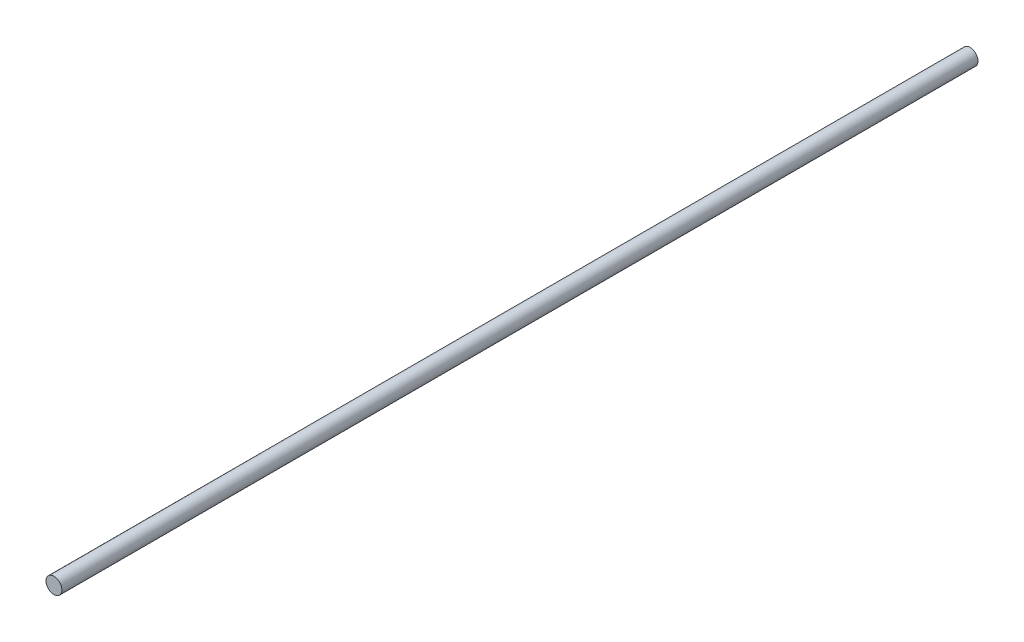
ISO-10303-21;
HEADER;
FILE_DESCRIPTION(('STEP AP214'),'2;1');
FILE_NAME('part.step','',(''),(''),'','','');
FILE_SCHEMA(('AUTOMOTIVE_DESIGN { 1 0 10303 214 1 1 1 1 }'));
ENDSEC;
DATA;
#1=APPLICATION_CONTEXT('core data for automotive mechanical design processes');
#2=APPLICATION_PROTOCOL_DEFINITION('international standard','automotive_design',2000,#1);
#3=PRODUCT_CONTEXT('',#1,'mechanical');
#4=PRODUCT('Part','Part','',(#3));
#5=PRODUCT_RELATED_PRODUCT_CATEGORY('part','',(#4));
#6=PRODUCT_DEFINITION_FORMATION('','',#4);
#7=PRODUCT_DEFINITION_CONTEXT('part definition',#1,'design');
#8=PRODUCT_DEFINITION('design','',#6,#7);
#9=PRODUCT_DEFINITION_SHAPE('','',#8);
#10=(LENGTH_UNIT() NAMED_UNIT(*) SI_UNIT(.MILLI.,.METRE.));
#11=(NAMED_UNIT(*) PLANE_ANGLE_UNIT() SI_UNIT($,.RADIAN.));
#12=(NAMED_UNIT(*) SI_UNIT($,.STERADIAN.) SOLID_ANGLE_UNIT());
#13=UNCERTAINTY_MEASURE_WITH_UNIT(LENGTH_MEASURE(1.E-05),#10,'distance_accuracy_value','');
#14=(GEOMETRIC_REPRESENTATION_CONTEXT(3) GLOBAL_UNCERTAINTY_ASSIGNED_CONTEXT((#13)) GLOBAL_UNIT_ASSIGNED_CONTEXT((#10,
#11,#12)) REPRESENTATION_CONTEXT('',''));
#15=CARTESIAN_POINT('',(0.,0.,0.));
#16=DIRECTION('',(0.,0.,1.));
#17=DIRECTION('',(1.,0.,0.));
#18=AXIS2_PLACEMENT_3D('',#15,#16,#17);
#19=CARTESIAN_POINT('',(0.,0.,75.));
#20=DIRECTION('',(0.,0.,-1.));
#21=DIRECTION('',(-1.,0.,0.));
#22=AXIS2_PLACEMENT_3D('',#19,#20,#21);
#23=CYLINDRICAL_SURFACE('',#22,0.65);
#24=CARTESIAN_POINT('',(0.,0.,75.));
#25=DIRECTION('',(0.,0.,1.));
#26=DIRECTION('',(1.,0.,0.));
#27=AXIS2_PLACEMENT_3D('',#24,#25,#26);
#28=CIRCLE('',#27,0.65);
#29=CARTESIAN_POINT('',(0.65,0.,75.));
#30=VERTEX_POINT('',#29);
#31=EDGE_CURVE('E10',#30,#30,#28,.T.);
#32=ORIENTED_EDGE('',*,*,#31,.F.);
#33=EDGE_LOOP('',(#32));
#34=FACE_BOUND('',#33,.T.);
#35=CARTESIAN_POINT('',(0.,0.,0.));
#36=DIRECTION('',(0.,0.,1.));
#37=DIRECTION('',(1.,0.,0.));
#38=AXIS2_PLACEMENT_3D('',#35,#36,#37);
#39=CIRCLE('',#38,0.65);
#40=CARTESIAN_POINT('',(0.65,0.,0.));
#41=VERTEX_POINT('',#40);
#42=EDGE_CURVE('E36',#41,#41,#39,.T.);
#43=ORIENTED_EDGE('',*,*,#42,.T.);
#44=EDGE_LOOP('',(#43));
#45=FACE_BOUND('',#44,.T.);
#46=ADVANCED_FACE('F33',(#34,#45),#23,.T.);
#47=CARTESIAN_POINT('',(0.,0.,75.));
#48=DIRECTION('',(0.,0.,1.));
#49=DIRECTION('',(1.,0.,0.));
#50=AXIS2_PLACEMENT_3D('',#47,#48,#49);
#51=PLANE('',#50);
#52=ORIENTED_EDGE('',*,*,#31,.T.);
#53=EDGE_LOOP('',(#52));
#54=FACE_BOUND('',#53,.T.);
#55=ADVANCED_FACE('F48',(#54),#51,.T.);
#56=CARTESIAN_POINT('',(0.,0.,0.));
#57=DIRECTION('',(0.,0.,1.));
#58=DIRECTION('',(1.,0.,0.));
#59=AXIS2_PLACEMENT_3D('',#56,#57,#58);
#60=PLANE('',#59);
#61=ORIENTED_EDGE('',*,*,#42,.F.);
#62=EDGE_LOOP('',(#61));
#63=FACE_BOUND('',#62,.T.);
#64=ADVANCED_FACE('F46',(#63),#60,.F.);
#65=CLOSED_SHELL('',(#46,#55,#64));
#66=MANIFOLD_SOLID_BREP('B2',#65);
#67=ADVANCED_BREP_SHAPE_REPRESENTATION('',(#18,#66),#14);
#68=SHAPE_DEFINITION_REPRESENTATION(#9,#67);
ENDSEC;
END-ISO-10303-21;
